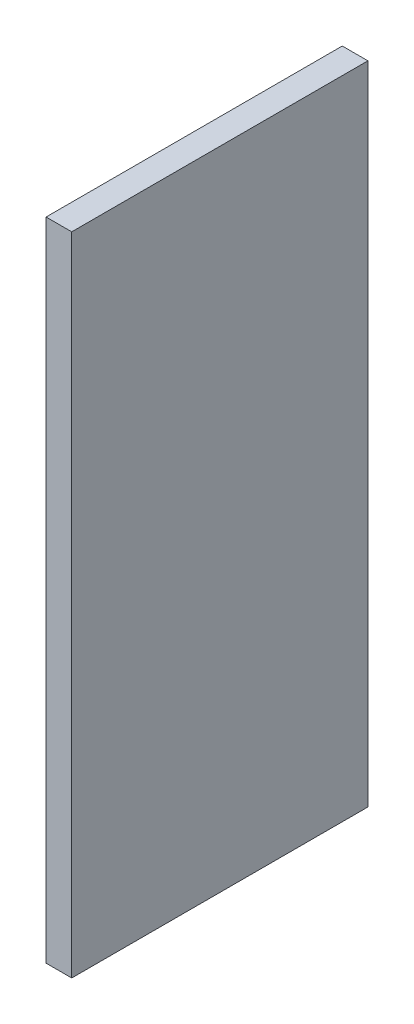
ISO-10303-21;
HEADER;
FILE_DESCRIPTION(('STEP AP214'),'2;1');
FILE_NAME('part.step','',(''),(''),'','','');
FILE_SCHEMA(('AUTOMOTIVE_DESIGN { 1 0 10303 214 1 1 1 1 }'));
ENDSEC;
DATA;
#1=APPLICATION_CONTEXT('core data for automotive mechanical design processes');
#2=APPLICATION_PROTOCOL_DEFINITION('international standard','automotive_design',2000,#1);
#3=PRODUCT_CONTEXT('',#1,'mechanical');
#4=PRODUCT('Part','Part','',(#3));
#5=PRODUCT_RELATED_PRODUCT_CATEGORY('part','',(#4));
#6=PRODUCT_DEFINITION_FORMATION('','',#4);
#7=PRODUCT_DEFINITION_CONTEXT('part definition',#1,'design');
#8=PRODUCT_DEFINITION('design','',#6,#7);
#9=PRODUCT_DEFINITION_SHAPE('','',#8);
#10=(LENGTH_UNIT() NAMED_UNIT(*) SI_UNIT(.MILLI.,.METRE.));
#11=(NAMED_UNIT(*) PLANE_ANGLE_UNIT() SI_UNIT($,.RADIAN.));
#12=(NAMED_UNIT(*) SI_UNIT($,.STERADIAN.) SOLID_ANGLE_UNIT());
#13=UNCERTAINTY_MEASURE_WITH_UNIT(LENGTH_MEASURE(1.E-05),#10,'distance_accuracy_value','');
#14=(GEOMETRIC_REPRESENTATION_CONTEXT(3) GLOBAL_UNCERTAINTY_ASSIGNED_CONTEXT((#13)) GLOBAL_UNIT_ASSIGNED_CONTEXT((#10,
#11,#12)) REPRESENTATION_CONTEXT('',''));
#15=CARTESIAN_POINT('',(0.,0.,0.));
#16=DIRECTION('',(0.,0.,1.));
#17=DIRECTION('',(1.,0.,0.));
#18=AXIS2_PLACEMENT_3D('',#15,#16,#17);
#19=CARTESIAN_POINT('',(4.7625,-60.,-27.5));
#20=DIRECTION('',(0.,0.,1.));
#21=DIRECTION('',(1.,0.,0.));
#22=AXIS2_PLACEMENT_3D('',#19,#20,#21);
#23=PLANE('',#22);
#24=DIRECTION('',(0.,1.,0.));
#25=VECTOR('',#24,1.);
#26=CARTESIAN_POINT('',(0.,-60.,-27.5));
#27=LINE('',#26,#25);
#28=CARTESIAN_POINT('',(0.,-60.,-27.5));
#29=VERTEX_POINT('',#28);
#30=CARTESIAN_POINT('',(0.,60.,-27.5));
#31=VERTEX_POINT('',#30);
#32=EDGE_CURVE('E95',#29,#31,#27,.T.);
#33=ORIENTED_EDGE('',*,*,#32,.T.);
#34=DIRECTION('',(-1.,0.,0.));
#35=VECTOR('',#34,1.);
#36=CARTESIAN_POINT('',(4.7625,60.,-27.5));
#37=LINE('',#36,#35);
#38=CARTESIAN_POINT('',(4.7625,60.,-27.5));
#39=VERTEX_POINT('',#38);
#40=EDGE_CURVE('E11',#39,#31,#37,.T.);
#41=ORIENTED_EDGE('',*,*,#40,.F.);
#42=DIRECTION('',(0.,1.,0.));
#43=VECTOR('',#42,1.);
#44=CARTESIAN_POINT('',(4.7625,-60.,-27.5));
#45=LINE('',#44,#43);
#46=CARTESIAN_POINT('',(4.7625,-60.,-27.5));
#47=VERTEX_POINT('',#46);
#48=EDGE_CURVE('E83',#47,#39,#45,.T.);
#49=ORIENTED_EDGE('',*,*,#48,.F.);
#50=DIRECTION('',(-1.,0.,0.));
#51=VECTOR('',#50,1.);
#52=CARTESIAN_POINT('',(4.7625,-60.,-27.5));
#53=LINE('',#52,#51);
#54=EDGE_CURVE('E91',#47,#29,#53,.T.);
#55=ORIENTED_EDGE('',*,*,#54,.T.);
#56=EDGE_LOOP('',(#33,#41,#49,#55));
#57=FACE_BOUND('',#56,.T.);
#58=ADVANCED_FACE('F32',(#57),#23,.F.);
#59=CARTESIAN_POINT('',(4.7625,60.,27.5));
#60=DIRECTION('',(0.,-1.,0.));
#61=DIRECTION('',(0.,0.,-1.));
#62=AXIS2_PLACEMENT_3D('',#59,#60,#61);
#63=PLANE('',#62);
#64=DIRECTION('',(0.,0.,1.));
#65=VECTOR('',#64,1.);
#66=CARTESIAN_POINT('',(0.,60.,27.5));
#67=LINE('',#66,#65);
#68=CARTESIAN_POINT('',(0.,60.,27.5));
#69=VERTEX_POINT('',#68);
#70=EDGE_CURVE('E87',#31,#69,#67,.T.);
#71=ORIENTED_EDGE('',*,*,#70,.T.);
#72=DIRECTION('',(-1.,0.,0.));
#73=VECTOR('',#72,1.);
#74=CARTESIAN_POINT('',(4.7625,60.,27.5));
#75=LINE('',#74,#73);
#76=CARTESIAN_POINT('',(4.7625,60.,27.5));
#77=VERTEX_POINT('',#76);
#78=EDGE_CURVE('E40',#77,#69,#75,.T.);
#79=ORIENTED_EDGE('',*,*,#78,.F.);
#80=DIRECTION('',(0.,0.,1.));
#81=VECTOR('',#80,1.);
#82=CARTESIAN_POINT('',(4.7625,60.,27.5));
#83=LINE('',#82,#81);
#84=EDGE_CURVE('E78',#39,#77,#83,.T.);
#85=ORIENTED_EDGE('',*,*,#84,.F.);
#86=ORIENTED_EDGE('',*,*,#40,.T.);
#87=EDGE_LOOP('',(#71,#79,#85,#86));
#88=FACE_BOUND('',#87,.T.);
#89=ADVANCED_FACE('F86',(#88),#63,.F.);
#90=CARTESIAN_POINT('',(4.7625,-60.,27.5));
#91=DIRECTION('',(0.,0.,-1.));
#92=DIRECTION('',(-1.,0.,0.));
#93=AXIS2_PLACEMENT_3D('',#90,#91,#92);
#94=PLANE('',#93);
#95=DIRECTION('',(0.,-1.,0.));
#96=VECTOR('',#95,1.);
#97=CARTESIAN_POINT('',(0.,-60.,27.5));
#98=LINE('',#97,#96);
#99=CARTESIAN_POINT('',(0.,-60.,27.5));
#100=VERTEX_POINT('',#99);
#101=EDGE_CURVE('E65',#69,#100,#98,.T.);
#102=ORIENTED_EDGE('',*,*,#101,.T.);
#103=DIRECTION('',(-1.,0.,0.));
#104=VECTOR('',#103,1.);
#105=CARTESIAN_POINT('',(4.7625,-60.,27.5));
#106=LINE('',#105,#104);
#107=CARTESIAN_POINT('',(4.7625,-60.,27.5));
#108=VERTEX_POINT('',#107);
#109=EDGE_CURVE('E88',#108,#100,#106,.T.);
#110=ORIENTED_EDGE('',*,*,#109,.F.);
#111=DIRECTION('',(0.,-1.,0.));
#112=VECTOR('',#111,1.);
#113=CARTESIAN_POINT('',(4.7625,-60.,27.5));
#114=LINE('',#113,#112);
#115=EDGE_CURVE('E81',#77,#108,#114,.T.);
#116=ORIENTED_EDGE('',*,*,#115,.F.);
#117=ORIENTED_EDGE('',*,*,#78,.T.);
#118=EDGE_LOOP('',(#102,#110,#116,#117));
#119=FACE_BOUND('',#118,.T.);
#120=ADVANCED_FACE('F89',(#119),#94,.F.);
#121=CARTESIAN_POINT('',(4.7625,-60.,27.5));
#122=DIRECTION('',(0.,1.,0.));
#123=DIRECTION('',(0.,0.,1.));
#124=AXIS2_PLACEMENT_3D('',#121,#122,#123);
#125=PLANE('',#124);
#126=DIRECTION('',(0.,0.,-1.));
#127=VECTOR('',#126,1.);
#128=CARTESIAN_POINT('',(0.,-60.,27.5));
#129=LINE('',#128,#127);
#130=EDGE_CURVE('E71',#100,#29,#129,.T.);
#131=ORIENTED_EDGE('',*,*,#130,.T.);
#132=ORIENTED_EDGE('',*,*,#54,.F.);
#133=DIRECTION('',(0.,0.,-1.));
#134=VECTOR('',#133,1.);
#135=CARTESIAN_POINT('',(4.7625,-60.,27.5));
#136=LINE('',#135,#134);
#137=EDGE_CURVE('E48',#108,#47,#136,.T.);
#138=ORIENTED_EDGE('',*,*,#137,.F.);
#139=ORIENTED_EDGE('',*,*,#109,.T.);
#140=EDGE_LOOP('',(#131,#132,#138,#139));
#141=FACE_BOUND('',#140,.T.);
#142=ADVANCED_FACE('F102',(#141),#125,.F.);
#143=CARTESIAN_POINT('',(4.7625,0.,0.));
#144=DIRECTION('',(-1.,0.,0.));
#145=DIRECTION('',(0.,0.,1.));
#146=AXIS2_PLACEMENT_3D('',#143,#144,#145);
#147=PLANE('',#146);
#148=ORIENTED_EDGE('',*,*,#48,.T.);
#149=ORIENTED_EDGE('',*,*,#84,.T.);
#150=ORIENTED_EDGE('',*,*,#115,.T.);
#151=ORIENTED_EDGE('',*,*,#137,.T.);
#152=EDGE_LOOP('',(#148,#149,#150,#151));
#153=FACE_BOUND('',#152,.T.);
#154=ADVANCED_FACE('F79',(#153),#147,.F.);
#155=CARTESIAN_POINT('',(0.,0.,0.));
#156=DIRECTION('',(-1.,0.,0.));
#157=DIRECTION('',(0.,0.,1.));
#158=AXIS2_PLACEMENT_3D('',#155,#156,#157);
#159=PLANE('',#158);
#160=ORIENTED_EDGE('',*,*,#32,.F.);
#161=ORIENTED_EDGE('',*,*,#130,.F.);
#162=ORIENTED_EDGE('',*,*,#101,.F.);
#163=ORIENTED_EDGE('',*,*,#70,.F.);
#164=EDGE_LOOP('',(#160,#161,#162,#163));
#165=FACE_BOUND('',#164,.T.);
#166=ADVANCED_FACE('F105',(#165),#159,.T.);
#167=CLOSED_SHELL('',(#58,#89,#120,#142,#154,#166));
#168=MANIFOLD_SOLID_BREP('B2',#167);
#169=ADVANCED_BREP_SHAPE_REPRESENTATION('',(#18,#168),#14);
#170=SHAPE_DEFINITION_REPRESENTATION(#9,#169);
ENDSEC;
END-ISO-10303-21;
